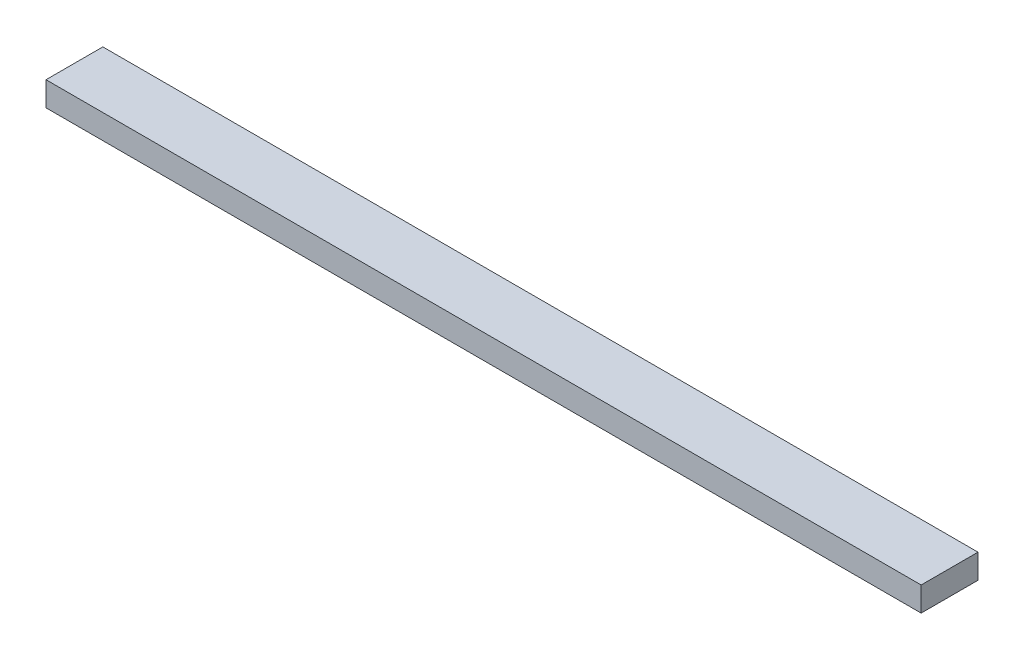
ISO-10303-21;
HEADER;
FILE_DESCRIPTION(('STEP AP214'),'2;1');
FILE_NAME('part.step','',(''),(''),'','','');
FILE_SCHEMA(('AUTOMOTIVE_DESIGN { 1 0 10303 214 1 1 1 1 }'));
ENDSEC;
DATA;
#1=APPLICATION_CONTEXT('core data for automotive mechanical design processes');
#2=APPLICATION_PROTOCOL_DEFINITION('international standard','automotive_design',2000,#1);
#3=PRODUCT_CONTEXT('',#1,'mechanical');
#4=PRODUCT('Part','Part','',(#3));
#5=PRODUCT_RELATED_PRODUCT_CATEGORY('part','',(#4));
#6=PRODUCT_DEFINITION_FORMATION('','',#4);
#7=PRODUCT_DEFINITION_CONTEXT('part definition',#1,'design');
#8=PRODUCT_DEFINITION('design','',#6,#7);
#9=PRODUCT_DEFINITION_SHAPE('','',#8);
#10=(LENGTH_UNIT() NAMED_UNIT(*) SI_UNIT(.MILLI.,.METRE.));
#11=(NAMED_UNIT(*) PLANE_ANGLE_UNIT() SI_UNIT($,.RADIAN.));
#12=(NAMED_UNIT(*) SI_UNIT($,.STERADIAN.) SOLID_ANGLE_UNIT());
#13=UNCERTAINTY_MEASURE_WITH_UNIT(LENGTH_MEASURE(1.E-05),#10,'distance_accuracy_value','');
#14=(GEOMETRIC_REPRESENTATION_CONTEXT(3) GLOBAL_UNCERTAINTY_ASSIGNED_CONTEXT((#13)) GLOBAL_UNIT_ASSIGNED_CONTEXT((#10,
#11,#12)) REPRESENTATION_CONTEXT('',''));
#15=CARTESIAN_POINT('',(0.,0.,0.));
#16=DIRECTION('',(0.,0.,1.));
#17=DIRECTION('',(1.,0.,0.));
#18=AXIS2_PLACEMENT_3D('',#15,#16,#17);
#19=CARTESIAN_POINT('',(0.,38.1,0.));
#20=DIRECTION('',(1.,0.,0.));
#21=DIRECTION('',(0.,0.,-1.));
#22=AXIS2_PLACEMENT_3D('',#19,#20,#21);
#23=PLANE('',#22);
#24=DIRECTION('',(0.,0.,1.));
#25=VECTOR('',#24,1.);
#26=CARTESIAN_POINT('',(0.,0.,0.));
#27=LINE('',#26,#25);
#28=CARTESIAN_POINT('',(0.,0.,-88.9));
#29=VERTEX_POINT('',#28);
#30=CARTESIAN_POINT('',(0.,0.,0.));
#31=VERTEX_POINT('',#30);
#32=EDGE_CURVE('E101',#29,#31,#27,.T.);
#33=ORIENTED_EDGE('',*,*,#32,.T.);
#34=DIRECTION('',(0.,-1.,0.));
#35=VECTOR('',#34,1.);
#36=CARTESIAN_POINT('',(0.,38.1,0.));
#37=LINE('',#36,#35);
#38=CARTESIAN_POINT('',(0.,38.1,0.));
#39=VERTEX_POINT('',#38);
#40=EDGE_CURVE('E11',#39,#31,#37,.T.);
#41=ORIENTED_EDGE('',*,*,#40,.F.);
#42=DIRECTION('',(0.,0.,1.));
#43=VECTOR('',#42,1.);
#44=CARTESIAN_POINT('',(0.,38.1,0.));
#45=LINE('',#44,#43);
#46=CARTESIAN_POINT('',(0.,38.1,-88.9));
#47=VERTEX_POINT('',#46);
#48=EDGE_CURVE('E89',#47,#39,#45,.T.);
#49=ORIENTED_EDGE('',*,*,#48,.F.);
#50=DIRECTION('',(0.,-1.,0.));
#51=VECTOR('',#50,1.);
#52=CARTESIAN_POINT('',(0.,38.1,-88.9));
#53=LINE('',#52,#51);
#54=EDGE_CURVE('E97',#47,#29,#53,.T.);
#55=ORIENTED_EDGE('',*,*,#54,.T.);
#56=EDGE_LOOP('',(#33,#41,#49,#55));
#57=FACE_BOUND('',#56,.T.);
#58=ADVANCED_FACE('F38',(#57),#23,.F.);
#59=CARTESIAN_POINT('',(0.,38.1,0.));
#60=DIRECTION('',(0.,0.,-1.));
#61=DIRECTION('',(-1.,0.,0.));
#62=AXIS2_PLACEMENT_3D('',#59,#60,#61);
#63=PLANE('',#62);
#64=DIRECTION('',(1.,0.,0.));
#65=VECTOR('',#64,1.);
#66=CARTESIAN_POINT('',(0.,0.,0.));
#67=LINE('',#66,#65);
#68=CARTESIAN_POINT('',(1368.4758,0.,0.));
#69=VERTEX_POINT('',#68);
#70=EDGE_CURVE('E93',#31,#69,#67,.T.);
#71=ORIENTED_EDGE('',*,*,#70,.T.);
#72=DIRECTION('',(0.,-1.,0.));
#73=VECTOR('',#72,1.);
#74=CARTESIAN_POINT('',(1368.4758,38.1,0.));
#75=LINE('',#74,#73);
#76=CARTESIAN_POINT('',(1368.4758,38.1,0.));
#77=VERTEX_POINT('',#76);
#78=EDGE_CURVE('E46',#77,#69,#75,.T.);
#79=ORIENTED_EDGE('',*,*,#78,.F.);
#80=DIRECTION('',(1.,0.,0.));
#81=VECTOR('',#80,1.);
#82=CARTESIAN_POINT('',(0.,38.1,0.));
#83=LINE('',#82,#81);
#84=EDGE_CURVE('E84',#39,#77,#83,.T.);
#85=ORIENTED_EDGE('',*,*,#84,.F.);
#86=ORIENTED_EDGE('',*,*,#40,.T.);
#87=EDGE_LOOP('',(#71,#79,#85,#86));
#88=FACE_BOUND('',#87,.T.);
#89=ADVANCED_FACE('F92',(#88),#63,.F.);
#90=CARTESIAN_POINT('',(1368.4758,38.1,0.));
#91=DIRECTION('',(-1.,0.,0.));
#92=DIRECTION('',(0.,0.,1.));
#93=AXIS2_PLACEMENT_3D('',#90,#91,#92);
#94=PLANE('',#93);
#95=DIRECTION('',(0.,0.,-1.));
#96=VECTOR('',#95,1.);
#97=CARTESIAN_POINT('',(1368.4758,0.,0.));
#98=LINE('',#97,#96);
#99=CARTESIAN_POINT('',(1368.4758,0.,-88.9));
#100=VERTEX_POINT('',#99);
#101=EDGE_CURVE('E71',#69,#100,#98,.T.);
#102=ORIENTED_EDGE('',*,*,#101,.T.);
#103=DIRECTION('',(0.,-1.,0.));
#104=VECTOR('',#103,1.);
#105=CARTESIAN_POINT('',(1368.4758,38.1,-88.9));
#106=LINE('',#105,#104);
#107=CARTESIAN_POINT('',(1368.4758,38.1,-88.9));
#108=VERTEX_POINT('',#107);
#109=EDGE_CURVE('E94',#108,#100,#106,.T.);
#110=ORIENTED_EDGE('',*,*,#109,.F.);
#111=DIRECTION('',(0.,0.,-1.));
#112=VECTOR('',#111,1.);
#113=CARTESIAN_POINT('',(1368.4758,38.1,0.));
#114=LINE('',#113,#112);
#115=EDGE_CURVE('E87',#77,#108,#114,.T.);
#116=ORIENTED_EDGE('',*,*,#115,.F.);
#117=ORIENTED_EDGE('',*,*,#78,.T.);
#118=EDGE_LOOP('',(#102,#110,#116,#117));
#119=FACE_BOUND('',#118,.T.);
#120=ADVANCED_FACE('F95',(#119),#94,.F.);
#121=CARTESIAN_POINT('',(0.,38.1,-88.9));
#122=DIRECTION('',(0.,0.,1.));
#123=DIRECTION('',(1.,0.,0.));
#124=AXIS2_PLACEMENT_3D('',#121,#122,#123);
#125=PLANE('',#124);
#126=DIRECTION('',(-1.,0.,0.));
#127=VECTOR('',#126,1.);
#128=CARTESIAN_POINT('',(0.,0.,-88.9));
#129=LINE('',#128,#127);
#130=EDGE_CURVE('E77',#100,#29,#129,.T.);
#131=ORIENTED_EDGE('',*,*,#130,.T.);
#132=ORIENTED_EDGE('',*,*,#54,.F.);
#133=DIRECTION('',(-1.,0.,0.));
#134=VECTOR('',#133,1.);
#135=CARTESIAN_POINT('',(0.,38.1,-88.9));
#136=LINE('',#135,#134);
#137=EDGE_CURVE('E54',#108,#47,#136,.T.);
#138=ORIENTED_EDGE('',*,*,#137,.F.);
#139=ORIENTED_EDGE('',*,*,#109,.T.);
#140=EDGE_LOOP('',(#131,#132,#138,#139));
#141=FACE_BOUND('',#140,.T.);
#142=ADVANCED_FACE('F108',(#141),#125,.F.);
#143=CARTESIAN_POINT('',(0.,38.1,0.));
#144=DIRECTION('',(0.,-1.,0.));
#145=DIRECTION('',(0.,0.,-1.));
#146=AXIS2_PLACEMENT_3D('',#143,#144,#145);
#147=PLANE('',#146);
#148=ORIENTED_EDGE('',*,*,#48,.T.);
#149=ORIENTED_EDGE('',*,*,#84,.T.);
#150=ORIENTED_EDGE('',*,*,#115,.T.);
#151=ORIENTED_EDGE('',*,*,#137,.T.);
#152=EDGE_LOOP('',(#148,#149,#150,#151));
#153=FACE_BOUND('',#152,.T.);
#154=ADVANCED_FACE('F85',(#153),#147,.F.);
#155=CARTESIAN_POINT('',(0.,0.,0.));
#156=DIRECTION('',(0.,-1.,0.));
#157=DIRECTION('',(0.,0.,-1.));
#158=AXIS2_PLACEMENT_3D('',#155,#156,#157);
#159=PLANE('',#158);
#160=ORIENTED_EDGE('',*,*,#32,.F.);
#161=ORIENTED_EDGE('',*,*,#130,.F.);
#162=ORIENTED_EDGE('',*,*,#101,.F.);
#163=ORIENTED_EDGE('',*,*,#70,.F.);
#164=EDGE_LOOP('',(#160,#161,#162,#163));
#165=FACE_BOUND('',#164,.T.);
#166=ADVANCED_FACE('F111',(#165),#159,.T.);
#167=CLOSED_SHELL('',(#58,#89,#120,#142,#154,#166));
#168=MANIFOLD_SOLID_BREP('B2',#167);
#169=ADVANCED_BREP_SHAPE_REPRESENTATION('',(#18,#168),#14);
#170=SHAPE_DEFINITION_REPRESENTATION(#9,#169);
ENDSEC;
END-ISO-10303-21;
